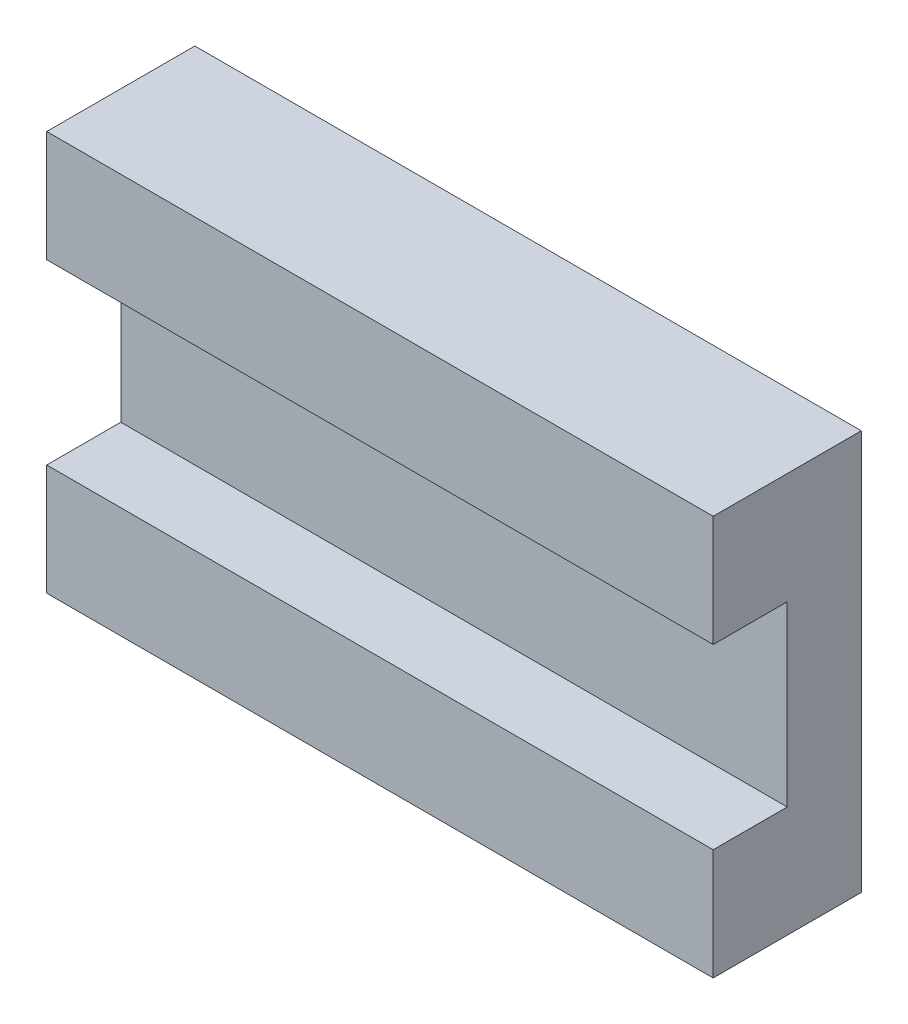
ISO-10303-21;
HEADER;
FILE_DESCRIPTION(('STEP AP214'),'2;1');
FILE_NAME('part.step','',(''),(''),'','','');
FILE_SCHEMA(('AUTOMOTIVE_DESIGN { 1 0 10303 214 1 1 1 1 }'));
ENDSEC;
DATA;
#1=APPLICATION_CONTEXT('core data for automotive mechanical design processes');
#2=APPLICATION_PROTOCOL_DEFINITION('international standard','automotive_design',2000,#1);
#3=PRODUCT_CONTEXT('',#1,'mechanical');
#4=PRODUCT('Part','Part','',(#3));
#5=PRODUCT_RELATED_PRODUCT_CATEGORY('part','',(#4));
#6=PRODUCT_DEFINITION_FORMATION('','',#4);
#7=PRODUCT_DEFINITION_CONTEXT('part definition',#1,'design');
#8=PRODUCT_DEFINITION('design','',#6,#7);
#9=PRODUCT_DEFINITION_SHAPE('','',#8);
#10=(LENGTH_UNIT() NAMED_UNIT(*) SI_UNIT(.MILLI.,.METRE.));
#11=(NAMED_UNIT(*) PLANE_ANGLE_UNIT() SI_UNIT($,.RADIAN.));
#12=(NAMED_UNIT(*) SI_UNIT($,.STERADIAN.) SOLID_ANGLE_UNIT());
#13=UNCERTAINTY_MEASURE_WITH_UNIT(LENGTH_MEASURE(1.E-05),#10,'distance_accuracy_value','');
#14=(GEOMETRIC_REPRESENTATION_CONTEXT(3) GLOBAL_UNCERTAINTY_ASSIGNED_CONTEXT((#13)) GLOBAL_UNIT_ASSIGNED_CONTEXT((#10,
#11,#12)) REPRESENTATION_CONTEXT('',''));
#15=CARTESIAN_POINT('',(0.,0.,0.));
#16=DIRECTION('',(0.,0.,1.));
#17=DIRECTION('',(1.,0.,0.));
#18=AXIS2_PLACEMENT_3D('',#15,#16,#17);
#19=CARTESIAN_POINT('',(0.,0.,10.));
#20=DIRECTION('',(0.,0.,1.));
#21=DIRECTION('',(1.,0.,0.));
#22=AXIS2_PLACEMENT_3D('',#19,#20,#21);
#23=PLANE('',#22);
#24=DIRECTION('',(1.,0.,0.));
#25=VECTOR('',#24,1.);
#26=CARTESIAN_POINT('',(-22.5,-6.,10.));
#27=LINE('',#26,#25);
#28=CARTESIAN_POINT('',(-22.5,-6.,10.));
#29=VERTEX_POINT('',#28);
#30=CARTESIAN_POINT('',(22.5,-6.,10.));
#31=VERTEX_POINT('',#30);
#32=EDGE_CURVE('E123',#29,#31,#27,.T.);
#33=ORIENTED_EDGE('',*,*,#32,.F.);
#34=DIRECTION('',(0.,1.,0.));
#35=VECTOR('',#34,1.);
#36=CARTESIAN_POINT('',(-22.5,0.,10.));
#37=LINE('',#36,#35);
#38=CARTESIAN_POINT('',(-22.5,-13.5,10.));
#39=VERTEX_POINT('',#38);
#40=EDGE_CURVE('E169',#39,#29,#37,.T.);
#41=ORIENTED_EDGE('',*,*,#40,.F.);
#42=DIRECTION('',(1.,0.,0.));
#43=VECTOR('',#42,1.);
#44=CARTESIAN_POINT('',(0.,-13.5,10.));
#45=LINE('',#44,#43);
#46=CARTESIAN_POINT('',(22.5,-13.5,10.));
#47=VERTEX_POINT('',#46);
#48=EDGE_CURVE('E161',#39,#47,#45,.T.);
#49=ORIENTED_EDGE('',*,*,#48,.T.);
#50=DIRECTION('',(0.,1.,0.));
#51=VECTOR('',#50,1.);
#52=CARTESIAN_POINT('',(22.5,0.,10.));
#53=LINE('',#52,#51);
#54=EDGE_CURVE('E86',#47,#31,#53,.T.);
#55=ORIENTED_EDGE('',*,*,#54,.T.);
#56=EDGE_LOOP('',(#33,#41,#49,#55));
#57=FACE_BOUND('',#56,.T.);
#58=ADVANCED_FACE('F36',(#57),#23,.T.);
#59=CARTESIAN_POINT('',(0.,-13.5,10.));
#60=DIRECTION('',(0.,1.,0.));
#61=DIRECTION('',(0.,0.,1.));
#62=AXIS2_PLACEMENT_3D('',#59,#60,#61);
#63=PLANE('',#62);
#64=DIRECTION('',(1.,0.,0.));
#65=VECTOR('',#64,1.);
#66=CARTESIAN_POINT('',(0.,-13.5,0.));
#67=LINE('',#66,#65);
#68=CARTESIAN_POINT('',(-22.5,-13.5,0.));
#69=VERTEX_POINT('',#68);
#70=CARTESIAN_POINT('',(22.5,-13.5,0.));
#71=VERTEX_POINT('',#70);
#72=EDGE_CURVE('E158',#69,#71,#67,.T.);
#73=ORIENTED_EDGE('',*,*,#72,.T.);
#74=DIRECTION('',(0.,0.,-1.));
#75=VECTOR('',#74,1.);
#76=CARTESIAN_POINT('',(22.5,-13.5,10.));
#77=LINE('',#76,#75);
#78=EDGE_CURVE('E11',#47,#71,#77,.T.);
#79=ORIENTED_EDGE('',*,*,#78,.F.);
#80=ORIENTED_EDGE('',*,*,#48,.F.);
#81=DIRECTION('',(0.,0.,-1.));
#82=VECTOR('',#81,1.);
#83=CARTESIAN_POINT('',(-22.5,-13.5,10.));
#84=LINE('',#83,#82);
#85=EDGE_CURVE('E60',#39,#69,#84,.T.);
#86=ORIENTED_EDGE('',*,*,#85,.T.);
#87=EDGE_LOOP('',(#73,#79,#80,#86));
#88=FACE_BOUND('',#87,.T.);
#89=ADVANCED_FACE('F38',(#88),#63,.F.);
#90=CARTESIAN_POINT('',(22.5,0.,10.));
#91=DIRECTION('',(-1.,0.,0.));
#92=DIRECTION('',(0.,0.,1.));
#93=AXIS2_PLACEMENT_3D('',#90,#91,#92);
#94=PLANE('',#93);
#95=DIRECTION('',(0.,1.,0.));
#96=VECTOR('',#95,1.);
#97=CARTESIAN_POINT('',(22.5,6.,5.));
#98=LINE('',#97,#96);
#99=CARTESIAN_POINT('',(22.5,-6.,5.));
#100=VERTEX_POINT('',#99);
#101=CARTESIAN_POINT('',(22.5,6.,5.));
#102=VERTEX_POINT('',#101);
#103=EDGE_CURVE('E116',#100,#102,#98,.T.);
#104=ORIENTED_EDGE('',*,*,#103,.F.);
#105=DIRECTION('',(0.,0.,1.));
#106=VECTOR('',#105,1.);
#107=CARTESIAN_POINT('',(22.5,-6.,5.));
#108=LINE('',#107,#106);
#109=EDGE_CURVE('E154',#100,#31,#108,.T.);
#110=ORIENTED_EDGE('',*,*,#109,.T.);
#111=ORIENTED_EDGE('',*,*,#54,.F.);
#112=ORIENTED_EDGE('',*,*,#78,.T.);
#113=DIRECTION('',(0.,1.,0.));
#114=VECTOR('',#113,1.);
#115=CARTESIAN_POINT('',(22.5,0.,0.));
#116=LINE('',#115,#114);
#117=CARTESIAN_POINT('',(22.5,13.5,0.));
#118=VERTEX_POINT('',#117);
#119=EDGE_CURVE('E172',#71,#118,#116,.T.);
#120=ORIENTED_EDGE('',*,*,#119,.T.);
#121=DIRECTION('',(0.,0.,-1.));
#122=VECTOR('',#121,1.);
#123=CARTESIAN_POINT('',(22.5,13.5,10.));
#124=LINE('',#123,#122);
#125=CARTESIAN_POINT('',(22.5,13.5,10.));
#126=VERTEX_POINT('',#125);
#127=EDGE_CURVE('E44',#126,#118,#124,.T.);
#128=ORIENTED_EDGE('',*,*,#127,.F.);
#129=CARTESIAN_POINT('',(22.5,6.,10.));
#130=VERTEX_POINT('',#129);
#131=EDGE_CURVE('E128',#130,#126,#53,.T.);
#132=ORIENTED_EDGE('',*,*,#131,.F.);
#133=DIRECTION('',(0.,0.,1.));
#134=VECTOR('',#133,1.);
#135=CARTESIAN_POINT('',(22.5,6.,5.));
#136=LINE('',#135,#134);
#137=EDGE_CURVE('E51',#102,#130,#136,.T.);
#138=ORIENTED_EDGE('',*,*,#137,.F.);
#139=EDGE_LOOP('',(#104,#110,#111,#112,#120,#128,#132,#138));
#140=FACE_BOUND('',#139,.T.);
#141=ADVANCED_FACE('F126',(#140),#94,.F.);
#142=CARTESIAN_POINT('',(0.,13.5,10.));
#143=DIRECTION('',(0.,1.,0.));
#144=DIRECTION('',(0.,0.,1.));
#145=AXIS2_PLACEMENT_3D('',#142,#143,#144);
#146=PLANE('',#145);
#147=DIRECTION('',(1.,0.,0.));
#148=VECTOR('',#147,1.);
#149=CARTESIAN_POINT('',(0.,13.5,0.));
#150=LINE('',#149,#148);
#151=CARTESIAN_POINT('',(-22.5,13.5,0.));
#152=VERTEX_POINT('',#151);
#153=EDGE_CURVE('E175',#152,#118,#150,.T.);
#154=ORIENTED_EDGE('',*,*,#153,.F.);
#155=DIRECTION('',(0.,0.,-1.));
#156=VECTOR('',#155,1.);
#157=CARTESIAN_POINT('',(-22.5,13.5,10.));
#158=LINE('',#157,#156);
#159=CARTESIAN_POINT('',(-22.5,13.5,10.));
#160=VERTEX_POINT('',#159);
#161=EDGE_CURVE('E181',#160,#152,#158,.T.);
#162=ORIENTED_EDGE('',*,*,#161,.F.);
#163=DIRECTION('',(1.,0.,0.));
#164=VECTOR('',#163,1.);
#165=CARTESIAN_POINT('',(0.,13.5,10.));
#166=LINE('',#165,#164);
#167=EDGE_CURVE('E165',#160,#126,#166,.T.);
#168=ORIENTED_EDGE('',*,*,#167,.T.);
#169=ORIENTED_EDGE('',*,*,#127,.T.);
#170=EDGE_LOOP('',(#154,#162,#168,#169));
#171=FACE_BOUND('',#170,.T.);
#172=ADVANCED_FACE('F184',(#171),#146,.T.);
#173=CARTESIAN_POINT('',(-22.5,0.,10.));
#174=DIRECTION('',(-1.,0.,0.));
#175=DIRECTION('',(0.,0.,1.));
#176=AXIS2_PLACEMENT_3D('',#173,#174,#175);
#177=PLANE('',#176);
#178=DIRECTION('',(0.,0.,1.));
#179=VECTOR('',#178,1.);
#180=CARTESIAN_POINT('',(-22.5,-6.,5.));
#181=LINE('',#180,#179);
#182=CARTESIAN_POINT('',(-22.5,-6.,5.));
#183=VERTEX_POINT('',#182);
#184=EDGE_CURVE('E130',#183,#29,#181,.T.);
#185=ORIENTED_EDGE('',*,*,#184,.F.);
#186=DIRECTION('',(0.,-1.,0.));
#187=VECTOR('',#186,1.);
#188=CARTESIAN_POINT('',(-22.5,6.,5.));
#189=LINE('',#188,#187);
#190=CARTESIAN_POINT('',(-22.5,6.,5.));
#191=VERTEX_POINT('',#190);
#192=EDGE_CURVE('E115',#191,#183,#189,.T.);
#193=ORIENTED_EDGE('',*,*,#192,.F.);
#194=DIRECTION('',(0.,0.,1.));
#195=VECTOR('',#194,1.);
#196=CARTESIAN_POINT('',(-22.5,6.,5.));
#197=LINE('',#196,#195);
#198=CARTESIAN_POINT('',(-22.5,6.,10.));
#199=VERTEX_POINT('',#198);
#200=EDGE_CURVE('E112',#191,#199,#197,.T.);
#201=ORIENTED_EDGE('',*,*,#200,.T.);
#202=EDGE_CURVE('E168',#199,#160,#37,.T.);
#203=ORIENTED_EDGE('',*,*,#202,.T.);
#204=ORIENTED_EDGE('',*,*,#161,.T.);
#205=DIRECTION('',(0.,1.,0.));
#206=VECTOR('',#205,1.);
#207=CARTESIAN_POINT('',(-22.5,0.,0.));
#208=LINE('',#207,#206);
#209=EDGE_CURVE('E163',#69,#152,#208,.T.);
#210=ORIENTED_EDGE('',*,*,#209,.F.);
#211=ORIENTED_EDGE('',*,*,#85,.F.);
#212=ORIENTED_EDGE('',*,*,#40,.T.);
#213=EDGE_LOOP('',(#185,#193,#201,#203,#204,#210,#211,#212));
#214=FACE_BOUND('',#213,.T.);
#215=ADVANCED_FACE('F191',(#214),#177,.T.);
#216=DIRECTION('',(-1.,0.,0.));
#217=VECTOR('',#216,1.);
#218=CARTESIAN_POINT('',(-22.5,6.,10.));
#219=LINE('',#218,#217);
#220=EDGE_CURVE('E195',#130,#199,#219,.T.);
#221=ORIENTED_EDGE('',*,*,#220,.F.);
#222=ORIENTED_EDGE('',*,*,#131,.T.);
#223=ORIENTED_EDGE('',*,*,#167,.F.);
#224=ORIENTED_EDGE('',*,*,#202,.F.);
#225=EDGE_LOOP('',(#221,#222,#223,#224));
#226=FACE_BOUND('',#225,.T.);
#227=ADVANCED_FACE('F194',(#226),#23,.T.);
#228=CARTESIAN_POINT('',(0.,0.,0.));
#229=DIRECTION('',(0.,0.,1.));
#230=DIRECTION('',(1.,0.,0.));
#231=AXIS2_PLACEMENT_3D('',#228,#229,#230);
#232=PLANE('',#231);
#233=CARTESIAN_POINT('',(9.99999999999999,10.,0.));
#234=DIRECTION('',(0.,0.,1.));
#235=DIRECTION('',(1.,0.,0.));
#236=AXIS2_PLACEMENT_3D('',#233,#234,#235);
#237=CIRCLE('',#236,1.5);
#238=CARTESIAN_POINT('',(11.5,10.,0.));
#239=VERTEX_POINT('',#238);
#240=EDGE_CURVE('E139',#239,#239,#237,.T.);
#241=ORIENTED_EDGE('',*,*,#240,.T.);
#242=EDGE_LOOP('',(#241));
#243=FACE_BOUND('',#242,.T.);
#244=CARTESIAN_POINT('',(9.99999999999999,-10.,0.));
#245=DIRECTION('',(0.,0.,1.));
#246=DIRECTION('',(1.,0.,0.));
#247=AXIS2_PLACEMENT_3D('',#244,#245,#246);
#248=CIRCLE('',#247,1.5);
#249=CARTESIAN_POINT('',(11.5,-10.,0.));
#250=VERTEX_POINT('',#249);
#251=EDGE_CURVE('E145',#250,#250,#248,.T.);
#252=ORIENTED_EDGE('',*,*,#251,.T.);
#253=EDGE_LOOP('',(#252));
#254=FACE_BOUND('',#253,.T.);
#255=CARTESIAN_POINT('',(-10.,-10.,0.));
#256=DIRECTION('',(0.,0.,1.));
#257=DIRECTION('',(1.,0.,0.));
#258=AXIS2_PLACEMENT_3D('',#255,#256,#257);
#259=CIRCLE('',#258,1.5);
#260=CARTESIAN_POINT('',(-8.50000000000001,-10.,0.));
#261=VERTEX_POINT('',#260);
#262=EDGE_CURVE('E151',#261,#261,#259,.T.);
#263=ORIENTED_EDGE('',*,*,#262,.T.);
#264=EDGE_LOOP('',(#263));
#265=FACE_BOUND('',#264,.T.);
#266=CARTESIAN_POINT('',(-10.,10.,0.));
#267=DIRECTION('',(0.,0.,1.));
#268=DIRECTION('',(1.,0.,0.));
#269=AXIS2_PLACEMENT_3D('',#266,#267,#268);
#270=CIRCLE('',#269,1.5);
#271=CARTESIAN_POINT('',(-8.50000000000001,10.,0.));
#272=VERTEX_POINT('',#271);
#273=EDGE_CURVE('E138',#272,#272,#270,.T.);
#274=ORIENTED_EDGE('',*,*,#273,.T.);
#275=EDGE_LOOP('',(#274));
#276=FACE_BOUND('',#275,.T.);
#277=ORIENTED_EDGE('',*,*,#72,.F.);
#278=ORIENTED_EDGE('',*,*,#209,.T.);
#279=ORIENTED_EDGE('',*,*,#153,.T.);
#280=ORIENTED_EDGE('',*,*,#119,.F.);
#281=EDGE_LOOP('',(#277,#278,#279,#280));
#282=FACE_BOUND('',#281,.T.);
#283=ADVANCED_FACE('F189',(#243,#254,#265,#276,#282),#232,.F.);
#284=CARTESIAN_POINT('',(-10.,10.,5.));
#285=DIRECTION('',(0.,0.,-1.));
#286=DIRECTION('',(-1.,0.,0.));
#287=AXIS2_PLACEMENT_3D('',#284,#285,#286);
#288=CYLINDRICAL_SURFACE('',#287,1.5);
#289=CARTESIAN_POINT('',(-10.,10.,5.));
#290=DIRECTION('',(0.,0.,1.));
#291=DIRECTION('',(1.,0.,0.));
#292=AXIS2_PLACEMENT_3D('',#289,#290,#291);
#293=CIRCLE('',#292,1.5);
#294=CARTESIAN_POINT('',(-8.50000000000001,10.,5.));
#295=VERTEX_POINT('',#294);
#296=EDGE_CURVE('E155',#295,#295,#293,.T.);
#297=ORIENTED_EDGE('',*,*,#296,.T.);
#298=EDGE_LOOP('',(#297));
#299=FACE_BOUND('',#298,.T.);
#300=ORIENTED_EDGE('',*,*,#273,.F.);
#301=EDGE_LOOP('',(#300));
#302=FACE_BOUND('',#301,.T.);
#303=ADVANCED_FACE('F220',(#299,#302),#288,.F.);
#304=CARTESIAN_POINT('',(0.,0.,5.));
#305=DIRECTION('',(0.,0.,1.));
#306=DIRECTION('',(1.,0.,0.));
#307=AXIS2_PLACEMENT_3D('',#304,#305,#306);
#308=PLANE('',#307);
#309=ORIENTED_EDGE('',*,*,#296,.F.);
#310=EDGE_LOOP('',(#309));
#311=FACE_BOUND('',#310,.T.);
#312=ADVANCED_FACE('F299',(#311),#308,.F.);
#313=CARTESIAN_POINT('',(-10.,-10.,5.));
#314=DIRECTION('',(0.,0.,-1.));
#315=DIRECTION('',(-1.,0.,0.));
#316=AXIS2_PLACEMENT_3D('',#313,#314,#315);
#317=CYLINDRICAL_SURFACE('',#316,1.5);
#318=CARTESIAN_POINT('',(-10.,-10.,5.));
#319=DIRECTION('',(0.,0.,1.));
#320=DIRECTION('',(1.,0.,0.));
#321=AXIS2_PLACEMENT_3D('',#318,#319,#320);
#322=CIRCLE('',#321,1.5);
#323=CARTESIAN_POINT('',(-8.50000000000001,-10.,5.));
#324=VERTEX_POINT('',#323);
#325=EDGE_CURVE('E148',#324,#324,#322,.T.);
#326=ORIENTED_EDGE('',*,*,#325,.T.);
#327=EDGE_LOOP('',(#326));
#328=FACE_BOUND('',#327,.T.);
#329=ORIENTED_EDGE('',*,*,#262,.F.);
#330=EDGE_LOOP('',(#329));
#331=FACE_BOUND('',#330,.T.);
#332=ADVANCED_FACE('F295',(#328,#331),#317,.F.);
#333=CARTESIAN_POINT('',(0.,0.,5.));
#334=DIRECTION('',(0.,0.,1.));
#335=DIRECTION('',(1.,0.,0.));
#336=AXIS2_PLACEMENT_3D('',#333,#334,#335);
#337=PLANE('',#336);
#338=ORIENTED_EDGE('',*,*,#325,.F.);
#339=EDGE_LOOP('',(#338));
#340=FACE_BOUND('',#339,.T.);
#341=ADVANCED_FACE('F291',(#340),#337,.F.);
#342=CARTESIAN_POINT('',(9.99999999999999,-10.,5.));
#343=DIRECTION('',(0.,0.,-1.));
#344=DIRECTION('',(-1.,0.,0.));
#345=AXIS2_PLACEMENT_3D('',#342,#343,#344);
#346=CYLINDRICAL_SURFACE('',#345,1.5);
#347=CARTESIAN_POINT('',(9.99999999999999,-10.,5.));
#348=DIRECTION('',(0.,0.,1.));
#349=DIRECTION('',(1.,0.,0.));
#350=AXIS2_PLACEMENT_3D('',#347,#348,#349);
#351=CIRCLE('',#350,1.5);
#352=CARTESIAN_POINT('',(11.5,-10.,5.));
#353=VERTEX_POINT('',#352);
#354=EDGE_CURVE('E142',#353,#353,#351,.T.);
#355=ORIENTED_EDGE('',*,*,#354,.T.);
#356=EDGE_LOOP('',(#355));
#357=FACE_BOUND('',#356,.T.);
#358=ORIENTED_EDGE('',*,*,#251,.F.);
#359=EDGE_LOOP('',(#358));
#360=FACE_BOUND('',#359,.T.);
#361=ADVANCED_FACE('F287',(#357,#360),#346,.F.);
#362=CARTESIAN_POINT('',(0.,0.,5.));
#363=DIRECTION('',(0.,0.,1.));
#364=DIRECTION('',(1.,0.,0.));
#365=AXIS2_PLACEMENT_3D('',#362,#363,#364);
#366=PLANE('',#365);
#367=ORIENTED_EDGE('',*,*,#354,.F.);
#368=EDGE_LOOP('',(#367));
#369=FACE_BOUND('',#368,.T.);
#370=ADVANCED_FACE('F283',(#369),#366,.F.);
#371=CARTESIAN_POINT('',(9.99999999999999,10.,5.));
#372=DIRECTION('',(0.,0.,-1.));
#373=DIRECTION('',(-1.,0.,0.));
#374=AXIS2_PLACEMENT_3D('',#371,#372,#373);
#375=CYLINDRICAL_SURFACE('',#374,1.5);
#376=CARTESIAN_POINT('',(9.99999999999999,10.,5.));
#377=DIRECTION('',(0.,0.,1.));
#378=DIRECTION('',(1.,0.,0.));
#379=AXIS2_PLACEMENT_3D('',#376,#377,#378);
#380=CIRCLE('',#379,1.5);
#381=CARTESIAN_POINT('',(11.5,10.,5.));
#382=VERTEX_POINT('',#381);
#383=EDGE_CURVE('E135',#382,#382,#380,.T.);
#384=ORIENTED_EDGE('',*,*,#383,.T.);
#385=EDGE_LOOP('',(#384));
#386=FACE_BOUND('',#385,.T.);
#387=ORIENTED_EDGE('',*,*,#240,.F.);
#388=EDGE_LOOP('',(#387));
#389=FACE_BOUND('',#388,.T.);
#390=ADVANCED_FACE('F279',(#386,#389),#375,.F.);
#391=CARTESIAN_POINT('',(0.,0.,5.));
#392=DIRECTION('',(0.,0.,1.));
#393=DIRECTION('',(1.,0.,0.));
#394=AXIS2_PLACEMENT_3D('',#391,#392,#393);
#395=PLANE('',#394);
#396=ORIENTED_EDGE('',*,*,#383,.F.);
#397=EDGE_LOOP('',(#396));
#398=FACE_BOUND('',#397,.T.);
#399=ADVANCED_FACE('F256',(#398),#395,.F.);
#400=CARTESIAN_POINT('',(-22.5,-6.,5.));
#401=DIRECTION('',(0.,-1.,0.));
#402=DIRECTION('',(0.,0.,-1.));
#403=AXIS2_PLACEMENT_3D('',#400,#401,#402);
#404=PLANE('',#403);
#405=ORIENTED_EDGE('',*,*,#32,.T.);
#406=ORIENTED_EDGE('',*,*,#109,.F.);
#407=DIRECTION('',(1.,0.,0.));
#408=VECTOR('',#407,1.);
#409=CARTESIAN_POINT('',(-22.5,-6.,5.));
#410=LINE('',#409,#408);
#411=EDGE_CURVE('E122',#183,#100,#410,.T.);
#412=ORIENTED_EDGE('',*,*,#411,.F.);
#413=ORIENTED_EDGE('',*,*,#184,.T.);
#414=EDGE_LOOP('',(#405,#406,#412,#413));
#415=FACE_BOUND('',#414,.T.);
#416=ADVANCED_FACE('F202',(#415),#404,.F.);
#417=CARTESIAN_POINT('',(-22.5,6.,5.));
#418=DIRECTION('',(0.,1.,0.));
#419=DIRECTION('',(0.,0.,1.));
#420=AXIS2_PLACEMENT_3D('',#417,#418,#419);
#421=PLANE('',#420);
#422=ORIENTED_EDGE('',*,*,#220,.T.);
#423=ORIENTED_EDGE('',*,*,#200,.F.);
#424=DIRECTION('',(-1.,0.,0.));
#425=VECTOR('',#424,1.);
#426=CARTESIAN_POINT('',(-22.5,6.,5.));
#427=LINE('',#426,#425);
#428=EDGE_CURVE('E108',#102,#191,#427,.T.);
#429=ORIENTED_EDGE('',*,*,#428,.F.);
#430=ORIENTED_EDGE('',*,*,#137,.T.);
#431=EDGE_LOOP('',(#422,#423,#429,#430));
#432=FACE_BOUND('',#431,.T.);
#433=ADVANCED_FACE('F110',(#432),#421,.F.);
#434=CARTESIAN_POINT('',(0.,0.,5.));
#435=DIRECTION('',(0.,0.,1.));
#436=DIRECTION('',(1.,0.,0.));
#437=AXIS2_PLACEMENT_3D('',#434,#435,#436);
#438=PLANE('',#437);
#439=ORIENTED_EDGE('',*,*,#103,.T.);
#440=ORIENTED_EDGE('',*,*,#428,.T.);
#441=ORIENTED_EDGE('',*,*,#192,.T.);
#442=ORIENTED_EDGE('',*,*,#411,.T.);
#443=EDGE_LOOP('',(#439,#440,#441,#442));
#444=FACE_BOUND('',#443,.T.);
#445=ADVANCED_FACE('F120',(#444),#438,.T.);
#446=CLOSED_SHELL('',(#58,#89,#141,#172,#215,#227,#283,#303,#312,#332,#341,#361,#370,#390,#399,
#416,#433,#445));
#447=MANIFOLD_SOLID_BREP('B2',#446);
#448=ADVANCED_BREP_SHAPE_REPRESENTATION('',(#18,#447),#14);
#449=SHAPE_DEFINITION_REPRESENTATION(#9,#448);
ENDSEC;
END-ISO-10303-21;
